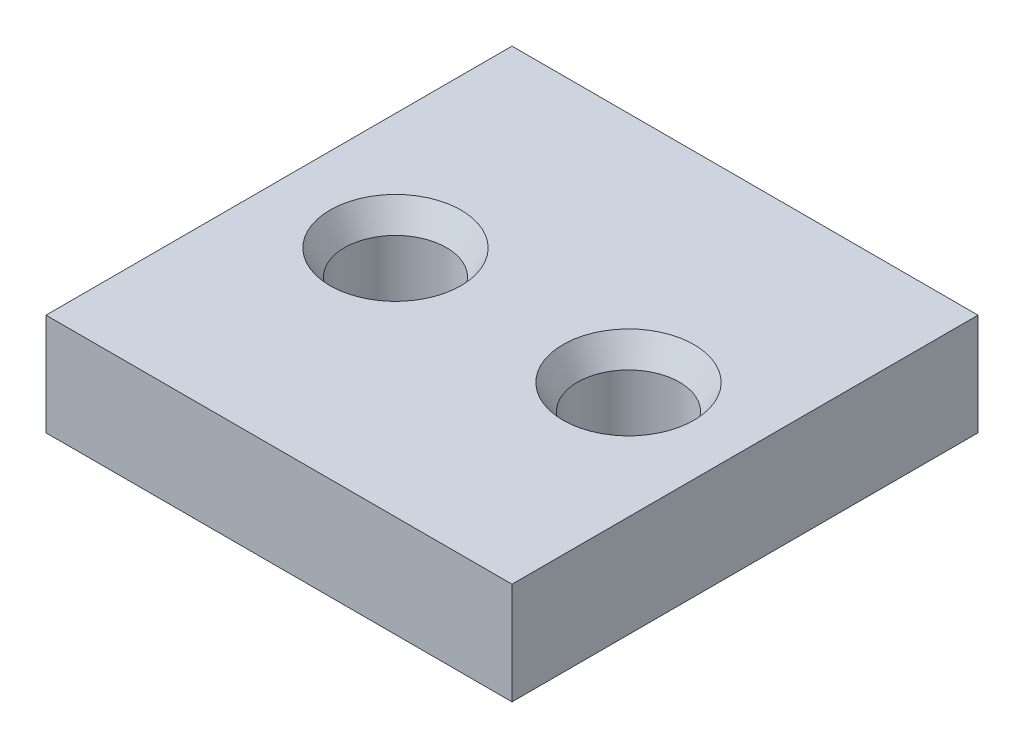
ISO-10303-21;
HEADER;
FILE_DESCRIPTION(('STEP AP214'),'2;1');
FILE_NAME('part.step','',(''),(''),'','','');
FILE_SCHEMA(('AUTOMOTIVE_DESIGN { 1 0 10303 214 1 1 1 1 }'));
ENDSEC;
DATA;
#1=APPLICATION_CONTEXT('core data for automotive mechanical design processes');
#2=APPLICATION_PROTOCOL_DEFINITION('international standard','automotive_design',2000,#1);
#3=PRODUCT_CONTEXT('',#1,'mechanical');
#4=PRODUCT('Part','Part','',(#3));
#5=PRODUCT_RELATED_PRODUCT_CATEGORY('part','',(#4));
#6=PRODUCT_DEFINITION_FORMATION('','',#4);
#7=PRODUCT_DEFINITION_CONTEXT('part definition',#1,'design');
#8=PRODUCT_DEFINITION('design','',#6,#7);
#9=PRODUCT_DEFINITION_SHAPE('','',#8);
#10=(LENGTH_UNIT() NAMED_UNIT(*) SI_UNIT(.MILLI.,.METRE.));
#11=(NAMED_UNIT(*) PLANE_ANGLE_UNIT() SI_UNIT($,.RADIAN.));
#12=(NAMED_UNIT(*) SI_UNIT($,.STERADIAN.) SOLID_ANGLE_UNIT());
#13=UNCERTAINTY_MEASURE_WITH_UNIT(LENGTH_MEASURE(1.E-05),#10,'distance_accuracy_value','');
#14=(GEOMETRIC_REPRESENTATION_CONTEXT(3) GLOBAL_UNCERTAINTY_ASSIGNED_CONTEXT((#13)) GLOBAL_UNIT_ASSIGNED_CONTEXT((#10,
#11,#12)) REPRESENTATION_CONTEXT('',''));
#15=CARTESIAN_POINT('',(0.,0.,0.));
#16=DIRECTION('',(0.,0.,1.));
#17=DIRECTION('',(1.,0.,0.));
#18=AXIS2_PLACEMENT_3D('',#15,#16,#17);
#19=CARTESIAN_POINT('',(16.,7.,-16.));
#20=DIRECTION('',(-1.,0.,0.));
#21=DIRECTION('',(0.,0.,1.));
#22=AXIS2_PLACEMENT_3D('',#19,#20,#21);
#23=PLANE('',#22);
#24=DIRECTION('',(0.,0.,-1.));
#25=VECTOR('',#24,1.);
#26=CARTESIAN_POINT('',(16.,0.,-16.));
#27=LINE('',#26,#25);
#28=CARTESIAN_POINT('',(16.,0.,16.));
#29=VERTEX_POINT('',#28);
#30=CARTESIAN_POINT('',(16.,0.,-16.));
#31=VERTEX_POINT('',#30);
#32=EDGE_CURVE('E96',#29,#31,#27,.T.);
#33=ORIENTED_EDGE('',*,*,#32,.T.);
#34=DIRECTION('',(0.,-1.,0.));
#35=VECTOR('',#34,1.);
#36=CARTESIAN_POINT('',(16.,7.,-16.));
#37=LINE('',#36,#35);
#38=CARTESIAN_POINT('',(16.,7.,-16.));
#39=VERTEX_POINT('',#38);
#40=EDGE_CURVE('E11',#39,#31,#37,.T.);
#41=ORIENTED_EDGE('',*,*,#40,.F.);
#42=DIRECTION('',(0.,0.,-1.));
#43=VECTOR('',#42,1.);
#44=CARTESIAN_POINT('',(16.,7.,-16.));
#45=LINE('',#44,#43);
#46=CARTESIAN_POINT('',(16.,7.,16.));
#47=VERTEX_POINT('',#46);
#48=EDGE_CURVE('E84',#47,#39,#45,.T.);
#49=ORIENTED_EDGE('',*,*,#48,.F.);
#50=DIRECTION('',(0.,-1.,0.));
#51=VECTOR('',#50,1.);
#52=CARTESIAN_POINT('',(16.,7.,16.));
#53=LINE('',#52,#51);
#54=EDGE_CURVE('E92',#47,#29,#53,.T.);
#55=ORIENTED_EDGE('',*,*,#54,.T.);
#56=EDGE_LOOP('',(#33,#41,#49,#55));
#57=FACE_BOUND('',#56,.T.);
#58=ADVANCED_FACE('F33',(#57),#23,.F.);
#59=CARTESIAN_POINT('',(-16.,7.,-16.));
#60=DIRECTION('',(0.,0.,1.));
#61=DIRECTION('',(1.,0.,0.));
#62=AXIS2_PLACEMENT_3D('',#59,#60,#61);
#63=PLANE('',#62);
#64=DIRECTION('',(-1.,0.,0.));
#65=VECTOR('',#64,1.);
#66=CARTESIAN_POINT('',(-16.,0.,-16.));
#67=LINE('',#66,#65);
#68=CARTESIAN_POINT('',(-16.,0.,-16.));
#69=VERTEX_POINT('',#68);
#70=EDGE_CURVE('E88',#31,#69,#67,.T.);
#71=ORIENTED_EDGE('',*,*,#70,.T.);
#72=DIRECTION('',(0.,-1.,0.));
#73=VECTOR('',#72,1.);
#74=CARTESIAN_POINT('',(-16.,7.,-16.));
#75=LINE('',#74,#73);
#76=CARTESIAN_POINT('',(-16.,7.,-16.));
#77=VERTEX_POINT('',#76);
#78=EDGE_CURVE('E41',#77,#69,#75,.T.);
#79=ORIENTED_EDGE('',*,*,#78,.F.);
#80=DIRECTION('',(-1.,0.,0.));
#81=VECTOR('',#80,1.);
#82=CARTESIAN_POINT('',(-16.,7.,-16.));
#83=LINE('',#82,#81);
#84=EDGE_CURVE('E79',#39,#77,#83,.T.);
#85=ORIENTED_EDGE('',*,*,#84,.F.);
#86=ORIENTED_EDGE('',*,*,#40,.T.);
#87=EDGE_LOOP('',(#71,#79,#85,#86));
#88=FACE_BOUND('',#87,.T.);
#89=ADVANCED_FACE('F87',(#88),#63,.F.);
#90=CARTESIAN_POINT('',(-16.,7.,-16.));
#91=DIRECTION('',(1.,0.,0.));
#92=DIRECTION('',(0.,0.,-1.));
#93=AXIS2_PLACEMENT_3D('',#90,#91,#92);
#94=PLANE('',#93);
#95=DIRECTION('',(0.,0.,1.));
#96=VECTOR('',#95,1.);
#97=CARTESIAN_POINT('',(-16.,0.,-16.));
#98=LINE('',#97,#96);
#99=CARTESIAN_POINT('',(-16.,0.,16.));
#100=VERTEX_POINT('',#99);
#101=EDGE_CURVE('E66',#69,#100,#98,.T.);
#102=ORIENTED_EDGE('',*,*,#101,.T.);
#103=DIRECTION('',(0.,-1.,0.));
#104=VECTOR('',#103,1.);
#105=CARTESIAN_POINT('',(-16.,7.,16.));
#106=LINE('',#105,#104);
#107=CARTESIAN_POINT('',(-16.,7.,16.));
#108=VERTEX_POINT('',#107);
#109=EDGE_CURVE('E89',#108,#100,#106,.T.);
#110=ORIENTED_EDGE('',*,*,#109,.F.);
#111=DIRECTION('',(0.,0.,1.));
#112=VECTOR('',#111,1.);
#113=CARTESIAN_POINT('',(-16.,7.,-16.));
#114=LINE('',#113,#112);
#115=EDGE_CURVE('E82',#77,#108,#114,.T.);
#116=ORIENTED_EDGE('',*,*,#115,.F.);
#117=ORIENTED_EDGE('',*,*,#78,.T.);
#118=EDGE_LOOP('',(#102,#110,#116,#117));
#119=FACE_BOUND('',#118,.T.);
#120=ADVANCED_FACE('F90',(#119),#94,.F.);
#121=CARTESIAN_POINT('',(-16.,7.,16.));
#122=DIRECTION('',(0.,0.,-1.));
#123=DIRECTION('',(-1.,0.,0.));
#124=AXIS2_PLACEMENT_3D('',#121,#122,#123);
#125=PLANE('',#124);
#126=DIRECTION('',(1.,0.,0.));
#127=VECTOR('',#126,1.);
#128=CARTESIAN_POINT('',(-16.,0.,16.));
#129=LINE('',#128,#127);
#130=EDGE_CURVE('E72',#100,#29,#129,.T.);
#131=ORIENTED_EDGE('',*,*,#130,.T.);
#132=ORIENTED_EDGE('',*,*,#54,.F.);
#133=DIRECTION('',(1.,0.,0.));
#134=VECTOR('',#133,1.);
#135=CARTESIAN_POINT('',(-16.,7.,16.));
#136=LINE('',#135,#134);
#137=EDGE_CURVE('E49',#108,#47,#136,.T.);
#138=ORIENTED_EDGE('',*,*,#137,.F.);
#139=ORIENTED_EDGE('',*,*,#109,.T.);
#140=EDGE_LOOP('',(#131,#132,#138,#139));
#141=FACE_BOUND('',#140,.T.);
#142=ADVANCED_FACE('F104',(#141),#125,.F.);
#143=CARTESIAN_POINT('',(0.,7.,0.));
#144=DIRECTION('',(0.,1.,0.));
#145=DIRECTION('',(0.,0.,1.));
#146=AXIS2_PLACEMENT_3D('',#143,#144,#145);
#147=PLANE('',#146);
#148=CARTESIAN_POINT('',(-8.,7.,0.));
#149=DIRECTION('',(0.,1.,0.));
#150=DIRECTION('',(0.,0.,1.));
#151=AXIS2_PLACEMENT_3D('',#148,#149,#150);
#152=CIRCLE('',#151,4.5);
#153=CARTESIAN_POINT('',(-8.,7.,4.5));
#154=VERTEX_POINT('',#153);
#155=EDGE_CURVE('E124',#154,#154,#152,.T.);
#156=ORIENTED_EDGE('',*,*,#155,.F.);
#157=EDGE_LOOP('',(#156));
#158=FACE_BOUND('',#157,.T.);
#159=CARTESIAN_POINT('',(8.,7.,0.));
#160=DIRECTION('',(0.,1.,0.));
#161=DIRECTION('',(0.,0.,1.));
#162=AXIS2_PLACEMENT_3D('',#159,#160,#161);
#163=CIRCLE('',#162,4.5);
#164=CARTESIAN_POINT('',(8.,7.,4.5));
#165=VERTEX_POINT('',#164);
#166=EDGE_CURVE('E115',#165,#165,#163,.T.);
#167=ORIENTED_EDGE('',*,*,#166,.F.);
#168=EDGE_LOOP('',(#167));
#169=FACE_BOUND('',#168,.T.);
#170=ORIENTED_EDGE('',*,*,#48,.T.);
#171=ORIENTED_EDGE('',*,*,#84,.T.);
#172=ORIENTED_EDGE('',*,*,#115,.T.);
#173=ORIENTED_EDGE('',*,*,#137,.T.);
#174=EDGE_LOOP('',(#170,#171,#172,#173));
#175=FACE_BOUND('',#174,.T.);
#176=ADVANCED_FACE('F80',(#158,#169,#175),#147,.T.);
#177=CARTESIAN_POINT('',(0.,0.,0.));
#178=DIRECTION('',(0.,1.,0.));
#179=DIRECTION('',(0.,0.,1.));
#180=AXIS2_PLACEMENT_3D('',#177,#178,#179);
#181=PLANE('',#180);
#182=CARTESIAN_POINT('',(-8.,0.,0.));
#183=DIRECTION('',(0.,1.,0.));
#184=DIRECTION('',(0.,0.,1.));
#185=AXIS2_PLACEMENT_3D('',#182,#183,#184);
#186=CIRCLE('',#185,3.5);
#187=CARTESIAN_POINT('',(-8.,0.,3.5));
#188=VERTEX_POINT('',#187);
#189=EDGE_CURVE('E118',#188,#188,#186,.T.);
#190=ORIENTED_EDGE('',*,*,#189,.T.);
#191=EDGE_LOOP('',(#190));
#192=FACE_BOUND('',#191,.T.);
#193=CARTESIAN_POINT('',(8.,0.,0.));
#194=DIRECTION('',(0.,1.,0.));
#195=DIRECTION('',(0.,0.,1.));
#196=AXIS2_PLACEMENT_3D('',#193,#194,#195);
#197=CIRCLE('',#196,3.5);
#198=CARTESIAN_POINT('',(8.,0.,3.5));
#199=VERTEX_POINT('',#198);
#200=EDGE_CURVE('E99',#199,#199,#197,.T.);
#201=ORIENTED_EDGE('',*,*,#200,.T.);
#202=EDGE_LOOP('',(#201));
#203=FACE_BOUND('',#202,.T.);
#204=ORIENTED_EDGE('',*,*,#32,.F.);
#205=ORIENTED_EDGE('',*,*,#130,.F.);
#206=ORIENTED_EDGE('',*,*,#101,.F.);
#207=ORIENTED_EDGE('',*,*,#70,.F.);
#208=EDGE_LOOP('',(#204,#205,#206,#207));
#209=FACE_BOUND('',#208,.T.);
#210=ADVANCED_FACE('F107',(#192,#203,#209),#181,.F.);
#211=CARTESIAN_POINT('',(8.,7.,0.));
#212=DIRECTION('',(0.,1.,0.));
#213=DIRECTION('',(0.,0.,1.));
#214=AXIS2_PLACEMENT_3D('',#211,#212,#213);
#215=CYLINDRICAL_SURFACE('',#214,3.5);
#216=ORIENTED_EDGE('',*,*,#200,.F.);
#217=EDGE_LOOP('',(#216));
#218=FACE_BOUND('',#217,.T.);
#219=CARTESIAN_POINT('',(8.,5.26794919243112,0.));
#220=DIRECTION('',(0.,1.,0.));
#221=DIRECTION('',(0.,0.,1.));
#222=AXIS2_PLACEMENT_3D('',#219,#220,#221);
#223=CIRCLE('',#222,3.5);
#224=CARTESIAN_POINT('',(8.,5.26794919243112,3.5));
#225=VERTEX_POINT('',#224);
#226=EDGE_CURVE('E112',#225,#225,#223,.T.);
#227=ORIENTED_EDGE('',*,*,#226,.T.);
#228=EDGE_LOOP('',(#227));
#229=FACE_BOUND('',#228,.T.);
#230=ADVANCED_FACE('F138',(#218,#229),#215,.F.);
#231=CARTESIAN_POINT('',(8.,7.,0.));
#232=DIRECTION('',(0.,1.,0.));
#233=DIRECTION('',(0.,0.,1.));
#234=AXIS2_PLACEMENT_3D('',#231,#232,#233);
#235=CONICAL_SURFACE('',#234,4.5,0.523598775598299);
#236=ORIENTED_EDGE('',*,*,#226,.F.);
#237=EDGE_LOOP('',(#236));
#238=FACE_BOUND('',#237,.T.);
#239=ORIENTED_EDGE('',*,*,#166,.T.);
#240=EDGE_LOOP('',(#239));
#241=FACE_BOUND('',#240,.T.);
#242=ADVANCED_FACE('F135',(#238,#241),#235,.F.);
#243=CARTESIAN_POINT('',(-8.,7.,0.));
#244=DIRECTION('',(0.,1.,0.));
#245=DIRECTION('',(0.,0.,1.));
#246=AXIS2_PLACEMENT_3D('',#243,#244,#245);
#247=CYLINDRICAL_SURFACE('',#246,3.5);
#248=ORIENTED_EDGE('',*,*,#189,.F.);
#249=EDGE_LOOP('',(#248));
#250=FACE_BOUND('',#249,.T.);
#251=CARTESIAN_POINT('',(-8.,5.26794919243112,0.));
#252=DIRECTION('',(0.,1.,0.));
#253=DIRECTION('',(0.,0.,1.));
#254=AXIS2_PLACEMENT_3D('',#251,#252,#253);
#255=CIRCLE('',#254,3.5);
#256=CARTESIAN_POINT('',(-8.,5.26794919243112,3.5));
#257=VERTEX_POINT('',#256);
#258=EDGE_CURVE('E121',#257,#257,#255,.T.);
#259=ORIENTED_EDGE('',*,*,#258,.T.);
#260=EDGE_LOOP('',(#259));
#261=FACE_BOUND('',#260,.T.);
#262=ADVANCED_FACE('F137',(#250,#261),#247,.F.);
#263=CARTESIAN_POINT('',(-8.,7.,0.));
#264=DIRECTION('',(0.,1.,0.));
#265=DIRECTION('',(0.,0.,1.));
#266=AXIS2_PLACEMENT_3D('',#263,#264,#265);
#267=CONICAL_SURFACE('',#266,4.5,0.523598775598299);
#268=ORIENTED_EDGE('',*,*,#258,.F.);
#269=EDGE_LOOP('',(#268));
#270=FACE_BOUND('',#269,.T.);
#271=ORIENTED_EDGE('',*,*,#155,.T.);
#272=EDGE_LOOP('',(#271));
#273=FACE_BOUND('',#272,.T.);
#274=ADVANCED_FACE('F128',(#270,#273),#267,.F.);
#275=CLOSED_SHELL('',(#58,#89,#120,#142,#176,#210,#230,#242,#262,#274));
#276=MANIFOLD_SOLID_BREP('B2',#275);
#277=ADVANCED_BREP_SHAPE_REPRESENTATION('',(#18,#276),#14);
#278=SHAPE_DEFINITION_REPRESENTATION(#9,#277);
ENDSEC;
END-ISO-10303-21;
